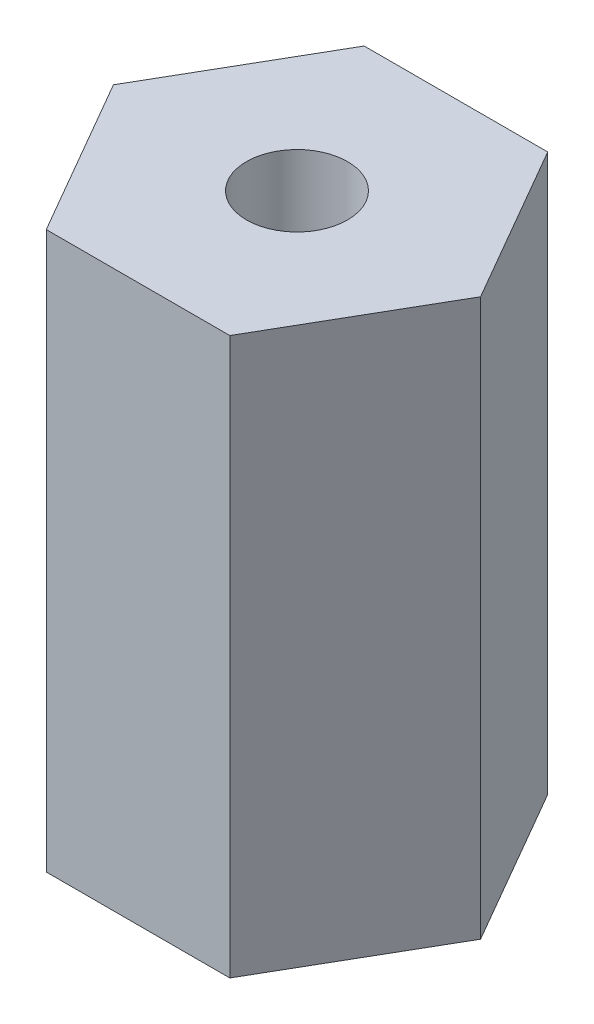
ISO-10303-21;
HEADER;
FILE_DESCRIPTION(('STEP AP214'),'2;1');
FILE_NAME('part.step','',(''),(''),'','','');
FILE_SCHEMA(('AUTOMOTIVE_DESIGN { 1 0 10303 214 1 1 1 1 }'));
ENDSEC;
DATA;
#1=APPLICATION_CONTEXT('core data for automotive mechanical design processes');
#2=APPLICATION_PROTOCOL_DEFINITION('international standard','automotive_design',2000,#1);
#3=PRODUCT_CONTEXT('',#1,'mechanical');
#4=PRODUCT('Part','Part','',(#3));
#5=PRODUCT_RELATED_PRODUCT_CATEGORY('part','',(#4));
#6=PRODUCT_DEFINITION_FORMATION('','',#4);
#7=PRODUCT_DEFINITION_CONTEXT('part definition',#1,'design');
#8=PRODUCT_DEFINITION('design','',#6,#7);
#9=PRODUCT_DEFINITION_SHAPE('','',#8);
#10=(LENGTH_UNIT() NAMED_UNIT(*) SI_UNIT(.MILLI.,.METRE.));
#11=(NAMED_UNIT(*) PLANE_ANGLE_UNIT() SI_UNIT($,.RADIAN.));
#12=(NAMED_UNIT(*) SI_UNIT($,.STERADIAN.) SOLID_ANGLE_UNIT());
#13=UNCERTAINTY_MEASURE_WITH_UNIT(LENGTH_MEASURE(1.E-05),#10,'distance_accuracy_value','');
#14=(GEOMETRIC_REPRESENTATION_CONTEXT(3) GLOBAL_UNCERTAINTY_ASSIGNED_CONTEXT((#13)) GLOBAL_UNIT_ASSIGNED_CONTEXT((#10,
#11,#12)) REPRESENTATION_CONTEXT('',''));
#15=CARTESIAN_POINT('',(0.,0.,0.));
#16=DIRECTION('',(0.,0.,1.));
#17=DIRECTION('',(1.,0.,0.));
#18=AXIS2_PLACEMENT_3D('',#15,#16,#17);
#19=CARTESIAN_POINT('',(3.66617420935412,22.225,6.35));
#20=DIRECTION('',(-0.866025403784438,0.,-0.5));
#21=DIRECTION('',(-0.5,0.,0.866025403784438));
#22=AXIS2_PLACEMENT_3D('',#19,#20,#21);
#23=PLANE('',#22);
#24=DIRECTION('',(0.5,0.,-0.866025403784438));
#25=VECTOR('',#24,1.);
#26=CARTESIAN_POINT('',(3.66617420935412,0.,6.35));
#27=LINE('',#26,#25);
#28=CARTESIAN_POINT('',(3.66617420935412,0.,6.35));
#29=VERTEX_POINT('',#28);
#30=CARTESIAN_POINT('',(7.33234841870825,0.,0.));
#31=VERTEX_POINT('',#30);
#32=EDGE_CURVE('E137',#29,#31,#27,.T.);
#33=ORIENTED_EDGE('',*,*,#32,.T.);
#34=DIRECTION('',(0.,-1.,0.));
#35=VECTOR('',#34,1.);
#36=CARTESIAN_POINT('',(7.33234841870825,22.225,0.));
#37=LINE('',#36,#35);
#38=CARTESIAN_POINT('',(7.33234841870825,22.225,0.));
#39=VERTEX_POINT('',#38);
#40=EDGE_CURVE('E11',#39,#31,#37,.T.);
#41=ORIENTED_EDGE('',*,*,#40,.F.);
#42=DIRECTION('',(0.5,0.,-0.866025403784438));
#43=VECTOR('',#42,1.);
#44=CARTESIAN_POINT('',(3.66617420935412,22.225,6.35));
#45=LINE('',#44,#43);
#46=CARTESIAN_POINT('',(3.66617420935412,22.225,6.35));
#47=VERTEX_POINT('',#46);
#48=EDGE_CURVE('E154',#47,#39,#45,.T.);
#49=ORIENTED_EDGE('',*,*,#48,.F.);
#50=DIRECTION('',(0.,-1.,0.));
#51=VECTOR('',#50,1.);
#52=CARTESIAN_POINT('',(3.66617420935412,22.225,6.35));
#53=LINE('',#52,#51);
#54=EDGE_CURVE('E133',#47,#29,#53,.T.);
#55=ORIENTED_EDGE('',*,*,#54,.T.);
#56=EDGE_LOOP('',(#33,#41,#49,#55));
#57=FACE_BOUND('',#56,.T.);
#58=ADVANCED_FACE('F46',(#57),#23,.F.);
#59=CARTESIAN_POINT('',(7.33234841870825,22.225,0.));
#60=DIRECTION('',(-0.866025403784439,0.,0.5));
#61=DIRECTION('',(0.5,0.,0.866025403784439));
#62=AXIS2_PLACEMENT_3D('',#59,#60,#61);
#63=PLANE('',#62);
#64=DIRECTION('',(-0.5,0.,-0.866025403784439));
#65=VECTOR('',#64,1.);
#66=CARTESIAN_POINT('',(7.33234841870825,0.,0.));
#67=LINE('',#66,#65);
#68=CARTESIAN_POINT('',(3.66617420935412,0.,-6.35));
#69=VERTEX_POINT('',#68);
#70=EDGE_CURVE('E141',#31,#69,#67,.T.);
#71=ORIENTED_EDGE('',*,*,#70,.T.);
#72=DIRECTION('',(0.,-1.,0.));
#73=VECTOR('',#72,1.);
#74=CARTESIAN_POINT('',(3.66617420935412,22.225,-6.35));
#75=LINE('',#74,#73);
#76=CARTESIAN_POINT('',(3.66617420935412,22.225,-6.35));
#77=VERTEX_POINT('',#76);
#78=EDGE_CURVE('E55',#77,#69,#75,.T.);
#79=ORIENTED_EDGE('',*,*,#78,.F.);
#80=DIRECTION('',(-0.5,0.,-0.866025403784439));
#81=VECTOR('',#80,1.);
#82=CARTESIAN_POINT('',(7.33234841870825,22.225,0.));
#83=LINE('',#82,#81);
#84=EDGE_CURVE('E101',#39,#77,#83,.T.);
#85=ORIENTED_EDGE('',*,*,#84,.F.);
#86=ORIENTED_EDGE('',*,*,#40,.T.);
#87=EDGE_LOOP('',(#71,#79,#85,#86));
#88=FACE_BOUND('',#87,.T.);
#89=ADVANCED_FACE('F183',(#88),#63,.F.);
#90=CARTESIAN_POINT('',(3.66617420935412,22.225,-6.35));
#91=DIRECTION('',(0.,0.,1.));
#92=DIRECTION('',(1.,0.,0.));
#93=AXIS2_PLACEMENT_3D('',#90,#91,#92);
#94=PLANE('',#93);
#95=DIRECTION('',(-1.,0.,0.));
#96=VECTOR('',#95,1.);
#97=CARTESIAN_POINT('',(3.66617420935412,0.,-6.35));
#98=LINE('',#97,#96);
#99=CARTESIAN_POINT('',(-3.66617420935412,0.,-6.35));
#100=VERTEX_POINT('',#99);
#101=EDGE_CURVE('E145',#69,#100,#98,.T.);
#102=ORIENTED_EDGE('',*,*,#101,.T.);
#103=DIRECTION('',(0.,-1.,0.));
#104=VECTOR('',#103,1.);
#105=CARTESIAN_POINT('',(-3.66617420935412,22.225,-6.35));
#106=LINE('',#105,#104);
#107=CARTESIAN_POINT('',(-3.66617420935412,22.225,-6.35));
#108=VERTEX_POINT('',#107);
#109=EDGE_CURVE('E126',#108,#100,#106,.T.);
#110=ORIENTED_EDGE('',*,*,#109,.F.);
#111=DIRECTION('',(-1.,0.,0.));
#112=VECTOR('',#111,1.);
#113=CARTESIAN_POINT('',(3.66617420935412,22.225,-6.35));
#114=LINE('',#113,#112);
#115=EDGE_CURVE('E115',#77,#108,#114,.T.);
#116=ORIENTED_EDGE('',*,*,#115,.F.);
#117=ORIENTED_EDGE('',*,*,#78,.T.);
#118=EDGE_LOOP('',(#102,#110,#116,#117));
#119=FACE_BOUND('',#118,.T.);
#120=ADVANCED_FACE('F164',(#119),#94,.F.);
#121=CARTESIAN_POINT('',(-3.66617420935412,22.225,-6.35));
#122=DIRECTION('',(0.866025403784438,0.,0.5));
#123=DIRECTION('',(0.5,0.,-0.866025403784439));
#124=AXIS2_PLACEMENT_3D('',#121,#122,#123);
#125=PLANE('',#124);
#126=DIRECTION('',(-0.5,0.,0.866025403784438));
#127=VECTOR('',#126,1.);
#128=CARTESIAN_POINT('',(-3.66617420935412,0.,-6.35));
#129=LINE('',#128,#127);
#130=CARTESIAN_POINT('',(-7.33234841870825,0.,0.));
#131=VERTEX_POINT('',#130);
#132=EDGE_CURVE('E124',#100,#131,#129,.T.);
#133=ORIENTED_EDGE('',*,*,#132,.T.);
#134=DIRECTION('',(0.,-1.,0.));
#135=VECTOR('',#134,1.);
#136=CARTESIAN_POINT('',(-7.33234841870825,22.225,0.));
#137=LINE('',#136,#135);
#138=CARTESIAN_POINT('',(-7.33234841870825,22.225,0.));
#139=VERTEX_POINT('',#138);
#140=EDGE_CURVE('E121',#139,#131,#137,.T.);
#141=ORIENTED_EDGE('',*,*,#140,.F.);
#142=DIRECTION('',(-0.5,0.,0.866025403784438));
#143=VECTOR('',#142,1.);
#144=CARTESIAN_POINT('',(-3.66617420935412,22.225,-6.35));
#145=LINE('',#144,#143);
#146=EDGE_CURVE('E109',#108,#139,#145,.T.);
#147=ORIENTED_EDGE('',*,*,#146,.F.);
#148=ORIENTED_EDGE('',*,*,#109,.T.);
#149=EDGE_LOOP('',(#133,#141,#147,#148));
#150=FACE_BOUND('',#149,.T.);
#151=ADVANCED_FACE('F122',(#150),#125,.F.);
#152=CARTESIAN_POINT('',(-7.33234841870825,22.225,0.));
#153=DIRECTION('',(0.866025403784439,0.,-0.5));
#154=DIRECTION('',(-0.5,0.,-0.866025403784439));
#155=AXIS2_PLACEMENT_3D('',#152,#153,#154);
#156=PLANE('',#155);
#157=DIRECTION('',(0.5,0.,0.866025403784439));
#158=VECTOR('',#157,1.);
#159=CARTESIAN_POINT('',(-7.33234841870825,0.,0.));
#160=LINE('',#159,#158);
#161=CARTESIAN_POINT('',(-3.66617420935412,0.,6.35));
#162=VERTEX_POINT('',#161);
#163=EDGE_CURVE('E87',#131,#162,#160,.T.);
#164=ORIENTED_EDGE('',*,*,#163,.T.);
#165=DIRECTION('',(0.,-1.,0.));
#166=VECTOR('',#165,1.);
#167=CARTESIAN_POINT('',(-3.66617420935412,22.225,6.35));
#168=LINE('',#167,#166);
#169=CARTESIAN_POINT('',(-3.66617420935412,22.225,6.35));
#170=VERTEX_POINT('',#169);
#171=EDGE_CURVE('E127',#170,#162,#168,.T.);
#172=ORIENTED_EDGE('',*,*,#171,.F.);
#173=DIRECTION('',(0.5,0.,0.866025403784439));
#174=VECTOR('',#173,1.);
#175=CARTESIAN_POINT('',(-7.33234841870825,22.225,0.));
#176=LINE('',#175,#174);
#177=EDGE_CURVE('E113',#139,#170,#176,.T.);
#178=ORIENTED_EDGE('',*,*,#177,.F.);
#179=ORIENTED_EDGE('',*,*,#140,.T.);
#180=EDGE_LOOP('',(#164,#172,#178,#179));
#181=FACE_BOUND('',#180,.T.);
#182=ADVANCED_FACE('F129',(#181),#156,.F.);
#183=CARTESIAN_POINT('',(-3.66617420935412,22.225,6.35));
#184=DIRECTION('',(0.,0.,-1.));
#185=DIRECTION('',(-1.,0.,0.));
#186=AXIS2_PLACEMENT_3D('',#183,#184,#185);
#187=PLANE('',#186);
#188=DIRECTION('',(1.,0.,0.));
#189=VECTOR('',#188,1.);
#190=CARTESIAN_POINT('',(-3.66617420935412,0.,6.35));
#191=LINE('',#190,#189);
#192=EDGE_CURVE('E93',#162,#29,#191,.T.);
#193=ORIENTED_EDGE('',*,*,#192,.T.);
#194=ORIENTED_EDGE('',*,*,#54,.F.);
#195=DIRECTION('',(1.,0.,0.));
#196=VECTOR('',#195,1.);
#197=CARTESIAN_POINT('',(-3.66617420935412,22.225,6.35));
#198=LINE('',#197,#196);
#199=EDGE_CURVE('E63',#170,#47,#198,.T.);
#200=ORIENTED_EDGE('',*,*,#199,.F.);
#201=ORIENTED_EDGE('',*,*,#171,.T.);
#202=EDGE_LOOP('',(#193,#194,#200,#201));
#203=FACE_BOUND('',#202,.T.);
#204=ADVANCED_FACE('F171',(#203),#187,.F.);
#205=CARTESIAN_POINT('',(0.,22.225,0.));
#206=DIRECTION('',(0.,1.,0.));
#207=DIRECTION('',(0.,0.,1.));
#208=AXIS2_PLACEMENT_3D('',#205,#206,#207);
#209=PLANE('',#208);
#210=CARTESIAN_POINT('',(0.,22.225,0.));
#211=DIRECTION('',(0.,1.,0.));
#212=DIRECTION('',(0.,0.,1.));
#213=AXIS2_PLACEMENT_3D('',#210,#211,#212);
#214=CIRCLE('',#213,2.01929999999999);
#215=CARTESIAN_POINT('',(0.,22.225,2.01929999999999));
#216=VERTEX_POINT('',#215);
#217=EDGE_CURVE('E287',#216,#216,#214,.T.);
#218=ORIENTED_EDGE('',*,*,#217,.F.);
#219=EDGE_LOOP('',(#218));
#220=FACE_BOUND('',#219,.T.);
#221=ORIENTED_EDGE('',*,*,#48,.T.);
#222=ORIENTED_EDGE('',*,*,#84,.T.);
#223=ORIENTED_EDGE('',*,*,#115,.T.);
#224=ORIENTED_EDGE('',*,*,#146,.T.);
#225=ORIENTED_EDGE('',*,*,#177,.T.);
#226=ORIENTED_EDGE('',*,*,#199,.T.);
#227=EDGE_LOOP('',(#221,#222,#223,#224,#225,#226));
#228=FACE_BOUND('',#227,.T.);
#229=ADVANCED_FACE('F111',(#220,#228),#209,.T.);
#230=CARTESIAN_POINT('',(0.,0.,0.));
#231=DIRECTION('',(0.,1.,0.));
#232=DIRECTION('',(0.,0.,1.));
#233=AXIS2_PLACEMENT_3D('',#230,#231,#232);
#234=PLANE('',#233);
#235=ORIENTED_EDGE('',*,*,#32,.F.);
#236=ORIENTED_EDGE('',*,*,#192,.F.);
#237=ORIENTED_EDGE('',*,*,#163,.F.);
#238=ORIENTED_EDGE('',*,*,#132,.F.);
#239=ORIENTED_EDGE('',*,*,#101,.F.);
#240=ORIENTED_EDGE('',*,*,#70,.F.);
#241=EDGE_LOOP('',(#235,#236,#237,#238,#239,#240));
#242=FACE_BOUND('',#241,.T.);
#243=ADVANCED_FACE('F167',(#242),#234,.F.);
#244=CARTESIAN_POINT('',(0.,8.6106,0.));
#245=DIRECTION('',(0.,1.,0.));
#246=DIRECTION('',(0.,0.,1.));
#247=AXIS2_PLACEMENT_3D('',#244,#245,#246);
#248=CONICAL_SURFACE('',#247,2.01929999999999,1.02974425867665);
#249=CARTESIAN_POINT('',(0.,7.39728215199765,0.));
#250=VERTEX_POINT('',#249);
#251=VERTEX_LOOP('',#250);
#252=FACE_BOUND('',#251,.T.);
#253=CARTESIAN_POINT('',(0.,8.6106,0.));
#254=DIRECTION('',(0.,1.,0.));
#255=DIRECTION('',(0.,0.,1.));
#256=AXIS2_PLACEMENT_3D('',#253,#254,#255);
#257=CIRCLE('',#256,2.01929999999999);
#258=CARTESIAN_POINT('',(0.,8.6106,2.01929999999999));
#259=VERTEX_POINT('',#258);
#260=EDGE_CURVE('E142',#259,#259,#257,.T.);
#261=ORIENTED_EDGE('',*,*,#260,.T.);
#262=EDGE_LOOP('',(#261));
#263=FACE_BOUND('',#262,.T.);
#264=ADVANCED_FACE('F217',(#252,#263),#248,.F.);
#265=CARTESIAN_POINT('',(0.,22.225,0.));
#266=DIRECTION('',(0.,1.,0.));
#267=DIRECTION('',(0.,0.,1.));
#268=AXIS2_PLACEMENT_3D('',#265,#266,#267);
#269=CYLINDRICAL_SURFACE('',#268,2.01929999999999);
#270=ORIENTED_EDGE('',*,*,#260,.F.);
#271=EDGE_LOOP('',(#270));
#272=FACE_BOUND('',#271,.T.);
#273=ORIENTED_EDGE('',*,*,#217,.T.);
#274=EDGE_LOOP('',(#273));
#275=FACE_BOUND('',#274,.T.);
#276=ADVANCED_FACE('F235',(#272,#275),#269,.F.);
#277=CLOSED_SHELL('',(#58,#89,#120,#151,#182,#204,#229,#243,#264,#276));
#278=MANIFOLD_SOLID_BREP('B2',#277);
#279=ADVANCED_BREP_SHAPE_REPRESENTATION('',(#18,#278),#14);
#280=SHAPE_DEFINITION_REPRESENTATION(#9,#279);
ENDSEC;
END-ISO-10303-21;
